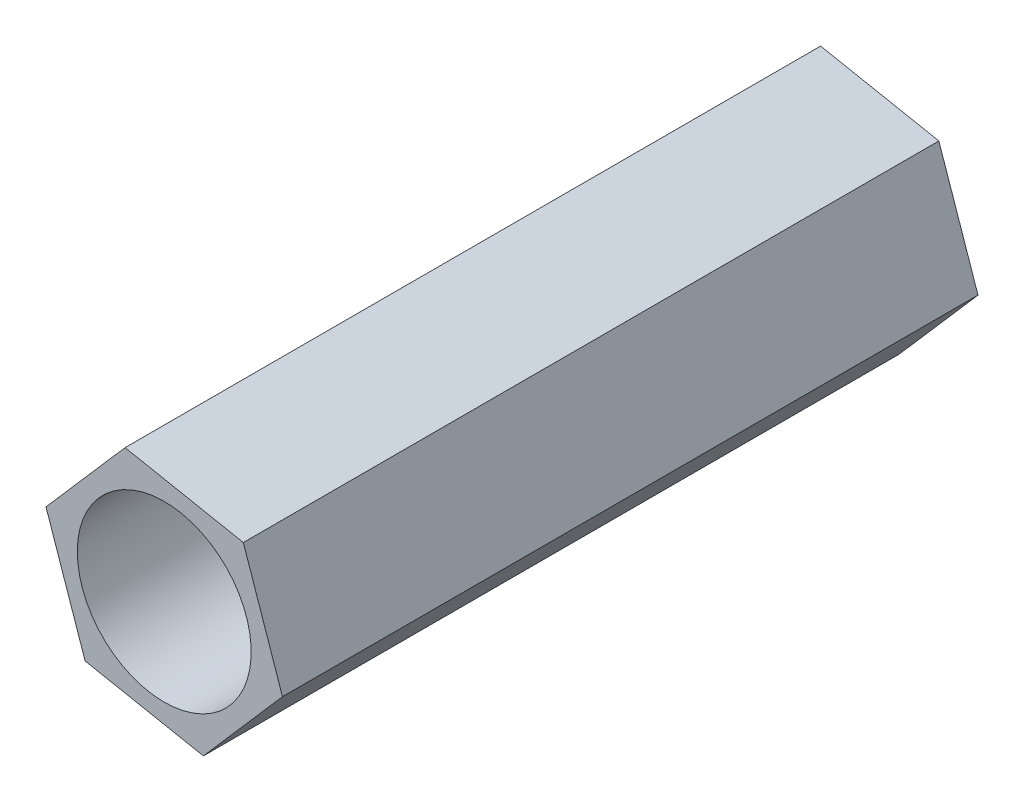
ISO-10303-21;
HEADER;
FILE_DESCRIPTION(('STEP AP214'),'2;1');
FILE_NAME('part.step','',(''),(''),'','','');
FILE_SCHEMA(('AUTOMOTIVE_DESIGN { 1 0 10303 214 1 1 1 1 }'));
ENDSEC;
DATA;
#1=APPLICATION_CONTEXT('core data for automotive mechanical design processes');
#2=APPLICATION_PROTOCOL_DEFINITION('international standard','automotive_design',2000,#1);
#3=PRODUCT_CONTEXT('',#1,'mechanical');
#4=PRODUCT('Part','Part','',(#3));
#5=PRODUCT_RELATED_PRODUCT_CATEGORY('part','',(#4));
#6=PRODUCT_DEFINITION_FORMATION('','',#4);
#7=PRODUCT_DEFINITION_CONTEXT('part definition',#1,'design');
#8=PRODUCT_DEFINITION('design','',#6,#7);
#9=PRODUCT_DEFINITION_SHAPE('','',#8);
#10=(LENGTH_UNIT() NAMED_UNIT(*) SI_UNIT(.MILLI.,.METRE.));
#11=(NAMED_UNIT(*) PLANE_ANGLE_UNIT() SI_UNIT($,.RADIAN.));
#12=(NAMED_UNIT(*) SI_UNIT($,.STERADIAN.) SOLID_ANGLE_UNIT());
#13=UNCERTAINTY_MEASURE_WITH_UNIT(LENGTH_MEASURE(1.E-05),#10,'distance_accuracy_value','');
#14=(GEOMETRIC_REPRESENTATION_CONTEXT(3) GLOBAL_UNCERTAINTY_ASSIGNED_CONTEXT((#13)) GLOBAL_UNIT_ASSIGNED_CONTEXT((#10,
#11,#12)) REPRESENTATION_CONTEXT('',''));
#15=CARTESIAN_POINT('',(0.,0.,0.));
#16=DIRECTION('',(0.,0.,1.));
#17=DIRECTION('',(1.,0.,0.));
#18=AXIS2_PLACEMENT_3D('',#15,#16,#17);
#19=CARTESIAN_POINT('',(-1.1372281323269,-1.30641194691578,-10.));
#20=DIRECTION('',(-0.191485421551265,-0.981495457622364,0.));
#21=DIRECTION('',(0.981495457622364,-0.191485421551265,0.));
#22=AXIS2_PLACEMENT_3D('',#19,#20,#21);
#23=PLANE('',#22);
#24=DIRECTION('',(0.981495457622364,-0.191485421551265,0.));
#25=VECTOR('',#24,1.);
#26=CARTESIAN_POINT('',(-1.1372281323269,-1.30641194691578,0.));
#27=LINE('',#26,#25);
#28=CARTESIAN_POINT('',(-1.1372281323269,-1.30641194691578,0.));
#29=VERTEX_POINT('',#28);
#30=CARTESIAN_POINT('',(0.562771867673103,-1.63807442595131,0.));
#31=VERTEX_POINT('',#30);
#32=EDGE_CURVE('E127',#29,#31,#27,.T.);
#33=ORIENTED_EDGE('',*,*,#32,.F.);
#34=DIRECTION('',(0.,0.,1.));
#35=VECTOR('',#34,1.);
#36=CARTESIAN_POINT('',(-1.1372281323269,-1.30641194691578,-10.));
#37=LINE('',#36,#35);
#38=CARTESIAN_POINT('',(-1.1372281323269,-1.30641194691578,-10.));
#39=VERTEX_POINT('',#38);
#40=EDGE_CURVE('E11',#39,#29,#37,.T.);
#41=ORIENTED_EDGE('',*,*,#40,.F.);
#42=DIRECTION('',(0.981495457622364,-0.191485421551265,0.));
#43=VECTOR('',#42,1.);
#44=CARTESIAN_POINT('',(-1.1372281323269,-1.30641194691578,-10.));
#45=LINE('',#44,#43);
#46=CARTESIAN_POINT('',(0.562771867673103,-1.63807442595131,-10.));
#47=VERTEX_POINT('',#46);
#48=EDGE_CURVE('E142',#39,#47,#45,.T.);
#49=ORIENTED_EDGE('',*,*,#48,.T.);
#50=DIRECTION('',(0.,0.,1.));
#51=VECTOR('',#50,1.);
#52=CARTESIAN_POINT('',(0.562771867673103,-1.63807442595131,-10.));
#53=LINE('',#52,#51);
#54=EDGE_CURVE('E45',#47,#31,#53,.T.);
#55=ORIENTED_EDGE('',*,*,#54,.T.);
#56=EDGE_LOOP('',(#33,#41,#49,#55));
#57=FACE_BOUND('',#56,.T.);
#58=ADVANCED_FACE('F42',(#57),#23,.T.);
#59=CARTESIAN_POINT('',(-1.7,0.331662479035535,-10.));
#60=DIRECTION('',(-0.945742710775633,-0.324916489293415,0.));
#61=DIRECTION('',(0.324916489293415,-0.945742710775633,0.));
#62=AXIS2_PLACEMENT_3D('',#59,#60,#61);
#63=PLANE('',#62);
#64=DIRECTION('',(0.324916489293415,-0.945742710775633,0.));
#65=VECTOR('',#64,1.);
#66=CARTESIAN_POINT('',(-1.7,0.331662479035535,0.));
#67=LINE('',#66,#65);
#68=CARTESIAN_POINT('',(-1.7,0.331662479035535,0.));
#69=VERTEX_POINT('',#68);
#70=EDGE_CURVE('E140',#69,#29,#67,.T.);
#71=ORIENTED_EDGE('',*,*,#70,.F.);
#72=DIRECTION('',(0.,0.,1.));
#73=VECTOR('',#72,1.);
#74=CARTESIAN_POINT('',(-1.7,0.331662479035535,-10.));
#75=LINE('',#74,#73);
#76=CARTESIAN_POINT('',(-1.7,0.331662479035535,-10.));
#77=VERTEX_POINT('',#76);
#78=EDGE_CURVE('E51',#77,#69,#75,.T.);
#79=ORIENTED_EDGE('',*,*,#78,.F.);
#80=DIRECTION('',(0.324916489293415,-0.945742710775633,0.));
#81=VECTOR('',#80,1.);
#82=CARTESIAN_POINT('',(-1.7,0.331662479035535,-10.));
#83=LINE('',#82,#81);
#84=EDGE_CURVE('E117',#77,#39,#83,.T.);
#85=ORIENTED_EDGE('',*,*,#84,.T.);
#86=ORIENTED_EDGE('',*,*,#40,.T.);
#87=EDGE_LOOP('',(#71,#79,#85,#86));
#88=FACE_BOUND('',#87,.T.);
#89=ADVANCED_FACE('F150',(#88),#63,.T.);
#90=CARTESIAN_POINT('',(-0.562771867673103,1.63807442595131,-10.));
#91=DIRECTION('',(-0.754257289224368,0.65657896832895,0.));
#92=DIRECTION('',(-0.65657896832895,-0.754257289224368,0.));
#93=AXIS2_PLACEMENT_3D('',#90,#91,#92);
#94=PLANE('',#93);
#95=DIRECTION('',(-0.65657896832895,-0.754257289224368,0.));
#96=VECTOR('',#95,1.);
#97=CARTESIAN_POINT('',(-0.562771867673103,1.63807442595131,0.));
#98=LINE('',#97,#96);
#99=CARTESIAN_POINT('',(-0.562771867673103,1.63807442595131,0.));
#100=VERTEX_POINT('',#99);
#101=EDGE_CURVE('E104',#100,#69,#98,.T.);
#102=ORIENTED_EDGE('',*,*,#101,.F.);
#103=DIRECTION('',(0.,0.,1.));
#104=VECTOR('',#103,1.);
#105=CARTESIAN_POINT('',(-0.562771867673103,1.63807442595131,-10.));
#106=LINE('',#105,#104);
#107=CARTESIAN_POINT('',(-0.562771867673103,1.63807442595131,-10.));
#108=VERTEX_POINT('',#107);
#109=EDGE_CURVE('E99',#108,#100,#106,.T.);
#110=ORIENTED_EDGE('',*,*,#109,.F.);
#111=DIRECTION('',(-0.65657896832895,-0.754257289224368,0.));
#112=VECTOR('',#111,1.);
#113=CARTESIAN_POINT('',(-0.562771867673103,1.63807442595131,-10.));
#114=LINE('',#113,#112);
#115=EDGE_CURVE('E102',#108,#77,#114,.T.);
#116=ORIENTED_EDGE('',*,*,#115,.T.);
#117=ORIENTED_EDGE('',*,*,#78,.T.);
#118=EDGE_LOOP('',(#102,#110,#116,#117));
#119=FACE_BOUND('',#118,.T.);
#120=ADVANCED_FACE('F101',(#119),#94,.T.);
#121=CARTESIAN_POINT('',(1.1372281323269,1.30641194691578,-10.));
#122=DIRECTION('',(0.191485421551265,0.981495457622364,0.));
#123=DIRECTION('',(-0.981495457622364,0.191485421551265,0.));
#124=AXIS2_PLACEMENT_3D('',#121,#122,#123);
#125=PLANE('',#124);
#126=DIRECTION('',(-0.981495457622364,0.191485421551265,0.));
#127=VECTOR('',#126,1.);
#128=CARTESIAN_POINT('',(1.1372281323269,1.30641194691578,0.));
#129=LINE('',#128,#127);
#130=CARTESIAN_POINT('',(1.1372281323269,1.30641194691578,0.));
#131=VERTEX_POINT('',#130);
#132=EDGE_CURVE('E137',#131,#100,#129,.T.);
#133=ORIENTED_EDGE('',*,*,#132,.F.);
#134=DIRECTION('',(0.,0.,1.));
#135=VECTOR('',#134,1.);
#136=CARTESIAN_POINT('',(1.1372281323269,1.30641194691578,-10.));
#137=LINE('',#136,#135);
#138=CARTESIAN_POINT('',(1.1372281323269,1.30641194691578,-10.));
#139=VERTEX_POINT('',#138);
#140=EDGE_CURVE('E109',#139,#131,#137,.T.);
#141=ORIENTED_EDGE('',*,*,#140,.F.);
#142=DIRECTION('',(-0.981495457622364,0.191485421551265,0.));
#143=VECTOR('',#142,1.);
#144=CARTESIAN_POINT('',(1.1372281323269,1.30641194691578,-10.));
#145=LINE('',#144,#143);
#146=EDGE_CURVE('E115',#139,#108,#145,.T.);
#147=ORIENTED_EDGE('',*,*,#146,.T.);
#148=ORIENTED_EDGE('',*,*,#109,.T.);
#149=EDGE_LOOP('',(#133,#141,#147,#148));
#150=FACE_BOUND('',#149,.T.);
#151=ADVANCED_FACE('F119',(#150),#125,.T.);
#152=CARTESIAN_POINT('',(1.7,-0.331662479035535,-10.));
#153=DIRECTION('',(0.945742710775633,0.324916489293415,0.));
#154=DIRECTION('',(-0.324916489293415,0.945742710775633,0.));
#155=AXIS2_PLACEMENT_3D('',#152,#153,#154);
#156=PLANE('',#155);
#157=DIRECTION('',(-0.324916489293415,0.945742710775633,0.));
#158=VECTOR('',#157,1.);
#159=CARTESIAN_POINT('',(1.7,-0.331662479035535,0.));
#160=LINE('',#159,#158);
#161=CARTESIAN_POINT('',(1.7,-0.331662479035535,0.));
#162=VERTEX_POINT('',#161);
#163=EDGE_CURVE('E134',#162,#131,#160,.T.);
#164=ORIENTED_EDGE('',*,*,#163,.F.);
#165=DIRECTION('',(0.,0.,1.));
#166=VECTOR('',#165,1.);
#167=CARTESIAN_POINT('',(1.7,-0.331662479035535,-10.));
#168=LINE('',#167,#166);
#169=CARTESIAN_POINT('',(1.7,-0.331662479035535,-10.));
#170=VERTEX_POINT('',#169);
#171=EDGE_CURVE('E145',#170,#162,#168,.T.);
#172=ORIENTED_EDGE('',*,*,#171,.F.);
#173=DIRECTION('',(-0.324916489293415,0.945742710775633,0.));
#174=VECTOR('',#173,1.);
#175=CARTESIAN_POINT('',(1.7,-0.331662479035535,-10.));
#176=LINE('',#175,#174);
#177=EDGE_CURVE('E120',#170,#139,#176,.T.);
#178=ORIENTED_EDGE('',*,*,#177,.T.);
#179=ORIENTED_EDGE('',*,*,#140,.T.);
#180=EDGE_LOOP('',(#164,#172,#178,#179));
#181=FACE_BOUND('',#180,.T.);
#182=ADVANCED_FACE('F163',(#181),#156,.T.);
#183=CARTESIAN_POINT('',(0.562771867673103,-1.63807442595131,-10.));
#184=DIRECTION('',(0.754257289224368,-0.656578968328949,0.));
#185=DIRECTION('',(0.65657896832895,0.754257289224368,0.));
#186=AXIS2_PLACEMENT_3D('',#183,#184,#185);
#187=PLANE('',#186);
#188=DIRECTION('',(0.656578968328949,0.754257289224368,0.));
#189=VECTOR('',#188,1.);
#190=CARTESIAN_POINT('',(0.562771867673103,-1.63807442595131,0.));
#191=LINE('',#190,#189);
#192=EDGE_CURVE('E130',#31,#162,#191,.T.);
#193=ORIENTED_EDGE('',*,*,#192,.F.);
#194=ORIENTED_EDGE('',*,*,#54,.F.);
#195=DIRECTION('',(0.656578968328949,0.754257289224368,0.));
#196=VECTOR('',#195,1.);
#197=CARTESIAN_POINT('',(0.562771867673103,-1.63807442595131,-10.));
#198=LINE('',#197,#196);
#199=EDGE_CURVE('E122',#47,#170,#198,.T.);
#200=ORIENTED_EDGE('',*,*,#199,.T.);
#201=ORIENTED_EDGE('',*,*,#171,.T.);
#202=EDGE_LOOP('',(#193,#194,#200,#201));
#203=FACE_BOUND('',#202,.T.);
#204=ADVANCED_FACE('F147',(#203),#187,.T.);
#205=CARTESIAN_POINT('',(0.,0.,-10.));
#206=DIRECTION('',(0.,0.,1.));
#207=DIRECTION('',(1.,0.,0.));
#208=AXIS2_PLACEMENT_3D('',#205,#206,#207);
#209=PLANE('',#208);
#210=CARTESIAN_POINT('',(0.,0.,-10.));
#211=DIRECTION('',(0.,0.,-1.));
#212=DIRECTION('',(-1.,0.,0.));
#213=AXIS2_PLACEMENT_3D('',#210,#211,#212);
#214=CIRCLE('',#213,1.25);
#215=CARTESIAN_POINT('',(-1.25,0.,-10.));
#216=VERTEX_POINT('',#215);
#217=EDGE_CURVE('E186',#216,#216,#214,.T.);
#218=ORIENTED_EDGE('',*,*,#217,.F.);
#219=EDGE_LOOP('',(#218));
#220=FACE_BOUND('',#219,.T.);
#221=ORIENTED_EDGE('',*,*,#48,.F.);
#222=ORIENTED_EDGE('',*,*,#84,.F.);
#223=ORIENTED_EDGE('',*,*,#115,.F.);
#224=ORIENTED_EDGE('',*,*,#146,.F.);
#225=ORIENTED_EDGE('',*,*,#177,.F.);
#226=ORIENTED_EDGE('',*,*,#199,.F.);
#227=EDGE_LOOP('',(#221,#222,#223,#224,#225,#226));
#228=FACE_BOUND('',#227,.T.);
#229=ADVANCED_FACE('F113',(#220,#228),#209,.F.);
#230=CARTESIAN_POINT('',(0.,0.,0.));
#231=DIRECTION('',(0.,0.,1.));
#232=DIRECTION('',(1.,0.,0.));
#233=AXIS2_PLACEMENT_3D('',#230,#231,#232);
#234=PLANE('',#233);
#235=CARTESIAN_POINT('',(0.,0.,0.));
#236=DIRECTION('',(0.,0.,-1.));
#237=DIRECTION('',(-1.,0.,0.));
#238=AXIS2_PLACEMENT_3D('',#235,#236,#237);
#239=CIRCLE('',#238,1.25);
#240=CARTESIAN_POINT('',(-1.25,0.,0.));
#241=VERTEX_POINT('',#240);
#242=EDGE_CURVE('E131',#241,#241,#239,.T.);
#243=ORIENTED_EDGE('',*,*,#242,.T.);
#244=EDGE_LOOP('',(#243));
#245=FACE_BOUND('',#244,.T.);
#246=ORIENTED_EDGE('',*,*,#32,.T.);
#247=ORIENTED_EDGE('',*,*,#192,.T.);
#248=ORIENTED_EDGE('',*,*,#163,.T.);
#249=ORIENTED_EDGE('',*,*,#132,.T.);
#250=ORIENTED_EDGE('',*,*,#101,.T.);
#251=ORIENTED_EDGE('',*,*,#70,.T.);
#252=EDGE_LOOP('',(#246,#247,#248,#249,#250,#251));
#253=FACE_BOUND('',#252,.T.);
#254=ADVANCED_FACE('F149',(#245,#253),#234,.T.);
#255=CARTESIAN_POINT('',(0.,0.,-10.));
#256=DIRECTION('',(0.,0.,-1.));
#257=DIRECTION('',(-1.,0.,0.));
#258=AXIS2_PLACEMENT_3D('',#255,#256,#257);
#259=CYLINDRICAL_SURFACE('',#258,1.25);
#260=ORIENTED_EDGE('',*,*,#242,.F.);
#261=EDGE_LOOP('',(#260));
#262=FACE_BOUND('',#261,.T.);
#263=ORIENTED_EDGE('',*,*,#217,.T.);
#264=EDGE_LOOP('',(#263));
#265=FACE_BOUND('',#264,.T.);
#266=ADVANCED_FACE('F174',(#262,#265),#259,.F.);
#267=CLOSED_SHELL('',(#58,#89,#120,#151,#182,#204,#229,#254,#266));
#268=MANIFOLD_SOLID_BREP('B2',#267);
#269=ADVANCED_BREP_SHAPE_REPRESENTATION('',(#18,#268),#14);
#270=SHAPE_DEFINITION_REPRESENTATION(#9,#269);
ENDSEC;
END-ISO-10303-21;
